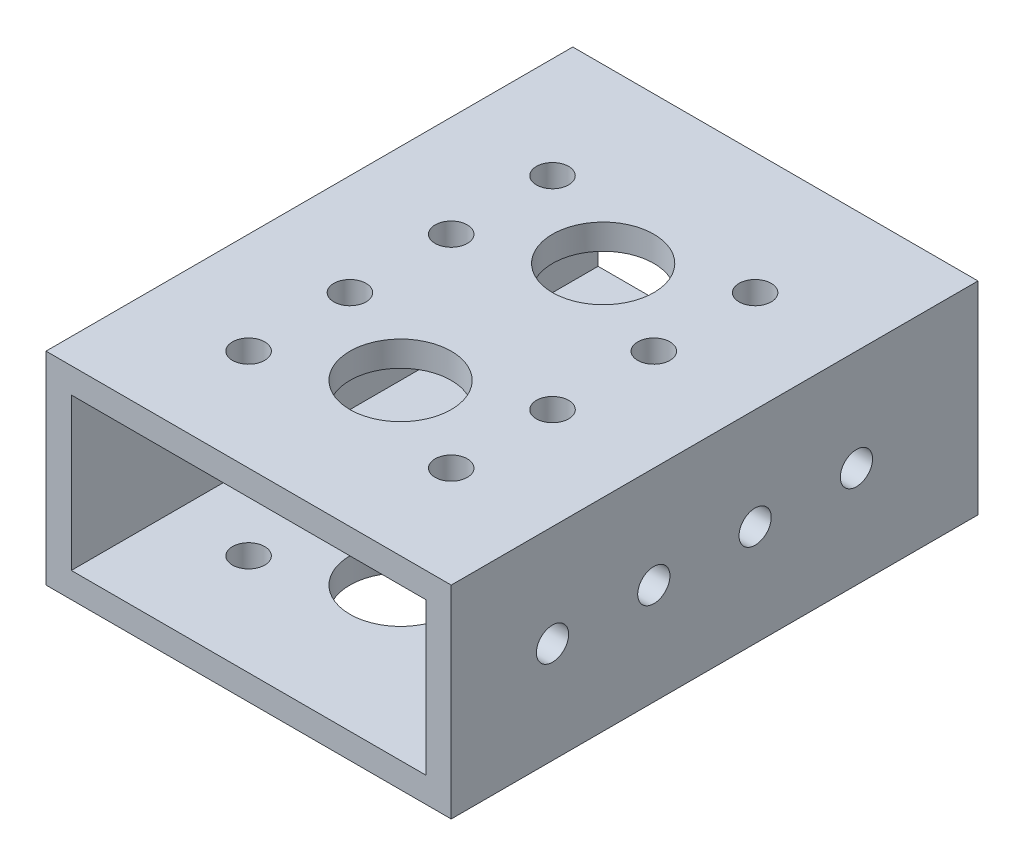
ISO-10303-21;
HEADER;
FILE_DESCRIPTION(('STEP AP214'),'2;1');
FILE_NAME('part.step','',(''),(''),'','','');
FILE_SCHEMA(('AUTOMOTIVE_DESIGN { 1 0 10303 214 1 1 1 1 }'));
ENDSEC;
DATA;
#1=APPLICATION_CONTEXT('core data for automotive mechanical design processes');
#2=APPLICATION_PROTOCOL_DEFINITION('international standard','automotive_design',2000,#1);
#3=PRODUCT_CONTEXT('',#1,'mechanical');
#4=PRODUCT('Part','Part','',(#3));
#5=PRODUCT_RELATED_PRODUCT_CATEGORY('part','',(#4));
#6=PRODUCT_DEFINITION_FORMATION('','',#4);
#7=PRODUCT_DEFINITION_CONTEXT('part definition',#1,'design');
#8=PRODUCT_DEFINITION('design','',#6,#7);
#9=PRODUCT_DEFINITION_SHAPE('','',#8);
#10=(LENGTH_UNIT() NAMED_UNIT(*) SI_UNIT(.MILLI.,.METRE.));
#11=(NAMED_UNIT(*) PLANE_ANGLE_UNIT() SI_UNIT($,.RADIAN.));
#12=(NAMED_UNIT(*) SI_UNIT($,.STERADIAN.) SOLID_ANGLE_UNIT());
#13=UNCERTAINTY_MEASURE_WITH_UNIT(LENGTH_MEASURE(1.E-05),#10,'distance_accuracy_value','');
#14=(GEOMETRIC_REPRESENTATION_CONTEXT(3) GLOBAL_UNCERTAINTY_ASSIGNED_CONTEXT((#13)) GLOBAL_UNIT_ASSIGNED_CONTEXT((#10,
#11,#12)) REPRESENTATION_CONTEXT('',''));
#15=CARTESIAN_POINT('',(0.,0.,0.));
#16=DIRECTION('',(0.,0.,1.));
#17=DIRECTION('',(1.,0.,0.));
#18=AXIS2_PLACEMENT_3D('',#15,#16,#17);
#19=CARTESIAN_POINT('',(0.,0.,66.04));
#20=DIRECTION('',(0.,0.,-1.));
#21=DIRECTION('',(-1.,0.,0.));
#22=AXIS2_PLACEMENT_3D('',#19,#20,#21);
#23=PLANE('',#22);
#24=DIRECTION('',(0.,-1.,0.));
#25=VECTOR('',#24,1.);
#26=CARTESIAN_POINT('',(0.,0.,66.04));
#27=LINE('',#26,#25);
#28=CARTESIAN_POINT('',(0.,25.4,66.04));
#29=VERTEX_POINT('',#28);
#30=CARTESIAN_POINT('',(0.,0.,66.04));
#31=VERTEX_POINT('',#30);
#32=EDGE_CURVE('E140',#29,#31,#27,.T.);
#33=ORIENTED_EDGE('',*,*,#32,.T.);
#34=DIRECTION('',(1.,0.,0.));
#35=VECTOR('',#34,1.);
#36=CARTESIAN_POINT('',(0.,0.,66.04));
#37=LINE('',#36,#35);
#38=CARTESIAN_POINT('',(50.8,0.,66.04));
#39=VERTEX_POINT('',#38);
#40=EDGE_CURVE('E143',#31,#39,#37,.T.);
#41=ORIENTED_EDGE('',*,*,#40,.T.);
#42=DIRECTION('',(0.,1.,0.));
#43=VECTOR('',#42,1.);
#44=CARTESIAN_POINT('',(50.8,0.,66.04));
#45=LINE('',#44,#43);
#46=CARTESIAN_POINT('',(50.8,25.4,66.04));
#47=VERTEX_POINT('',#46);
#48=EDGE_CURVE('E146',#39,#47,#45,.T.);
#49=ORIENTED_EDGE('',*,*,#48,.T.);
#50=DIRECTION('',(-1.,0.,0.));
#51=VECTOR('',#50,1.);
#52=CARTESIAN_POINT('',(0.,25.4,66.04));
#53=LINE('',#52,#51);
#54=EDGE_CURVE('E148',#47,#29,#53,.T.);
#55=ORIENTED_EDGE('',*,*,#54,.T.);
#56=EDGE_LOOP('',(#33,#41,#49,#55));
#57=FACE_BOUND('',#56,.T.);
#58=DIRECTION('',(0.,-1.,0.));
#59=VECTOR('',#58,1.);
#60=CARTESIAN_POINT('',(3.175,3.175,66.04));
#61=LINE('',#60,#59);
#62=CARTESIAN_POINT('',(3.175,22.225,66.04));
#63=VERTEX_POINT('',#62);
#64=CARTESIAN_POINT('',(3.175,3.175,66.04));
#65=VERTEX_POINT('',#64);
#66=EDGE_CURVE('E102',#63,#65,#61,.T.);
#67=ORIENTED_EDGE('',*,*,#66,.F.);
#68=DIRECTION('',(-1.,0.,0.));
#69=VECTOR('',#68,1.);
#70=CARTESIAN_POINT('',(3.175,22.225,66.04));
#71=LINE('',#70,#69);
#72=CARTESIAN_POINT('',(47.625,22.225,66.04));
#73=VERTEX_POINT('',#72);
#74=EDGE_CURVE('E124',#73,#63,#71,.T.);
#75=ORIENTED_EDGE('',*,*,#74,.F.);
#76=DIRECTION('',(0.,1.,0.));
#77=VECTOR('',#76,1.);
#78=CARTESIAN_POINT('',(47.625,3.175,66.04));
#79=LINE('',#78,#77);
#80=CARTESIAN_POINT('',(47.625,3.175,66.04));
#81=VERTEX_POINT('',#80);
#82=EDGE_CURVE('E122',#81,#73,#79,.T.);
#83=ORIENTED_EDGE('',*,*,#82,.F.);
#84=DIRECTION('',(1.,0.,0.));
#85=VECTOR('',#84,1.);
#86=CARTESIAN_POINT('',(3.175,3.175,66.04));
#87=LINE('',#86,#85);
#88=EDGE_CURVE('E110',#65,#81,#87,.T.);
#89=ORIENTED_EDGE('',*,*,#88,.F.);
#90=EDGE_LOOP('',(#67,#75,#83,#89));
#91=FACE_BOUND('',#90,.T.);
#92=ADVANCED_FACE('F35',(#57,#91),#23,.F.);
#93=CARTESIAN_POINT('',(0.,0.,0.));
#94=DIRECTION('',(0.,0.,-1.));
#95=DIRECTION('',(-1.,0.,0.));
#96=AXIS2_PLACEMENT_3D('',#93,#94,#95);
#97=PLANE('',#96);
#98=DIRECTION('',(0.,-1.,0.));
#99=VECTOR('',#98,1.);
#100=CARTESIAN_POINT('',(0.,0.,0.));
#101=LINE('',#100,#99);
#102=CARTESIAN_POINT('',(0.,25.4,0.));
#103=VERTEX_POINT('',#102);
#104=CARTESIAN_POINT('',(0.,0.,0.));
#105=VERTEX_POINT('',#104);
#106=EDGE_CURVE('E118',#103,#105,#101,.T.);
#107=ORIENTED_EDGE('',*,*,#106,.F.);
#108=DIRECTION('',(-1.,0.,0.));
#109=VECTOR('',#108,1.);
#110=CARTESIAN_POINT('',(0.,25.4,0.));
#111=LINE('',#110,#109);
#112=CARTESIAN_POINT('',(50.8,25.4,0.));
#113=VERTEX_POINT('',#112);
#114=EDGE_CURVE('E144',#113,#103,#111,.T.);
#115=ORIENTED_EDGE('',*,*,#114,.F.);
#116=DIRECTION('',(0.,1.,0.));
#117=VECTOR('',#116,1.);
#118=CARTESIAN_POINT('',(50.8,0.,0.));
#119=LINE('',#118,#117);
#120=CARTESIAN_POINT('',(50.8,0.,0.));
#121=VERTEX_POINT('',#120);
#122=EDGE_CURVE('E155',#121,#113,#119,.T.);
#123=ORIENTED_EDGE('',*,*,#122,.F.);
#124=DIRECTION('',(1.,0.,0.));
#125=VECTOR('',#124,1.);
#126=CARTESIAN_POINT('',(0.,0.,0.));
#127=LINE('',#126,#125);
#128=EDGE_CURVE('E153',#105,#121,#127,.T.);
#129=ORIENTED_EDGE('',*,*,#128,.F.);
#130=EDGE_LOOP('',(#107,#115,#123,#129));
#131=FACE_BOUND('',#130,.T.);
#132=DIRECTION('',(-1.,0.,0.));
#133=VECTOR('',#132,1.);
#134=CARTESIAN_POINT('',(3.175,22.225,0.));
#135=LINE('',#134,#133);
#136=CARTESIAN_POINT('',(47.625,22.225,0.));
#137=VERTEX_POINT('',#136);
#138=CARTESIAN_POINT('',(3.175,22.225,0.));
#139=VERTEX_POINT('',#138);
#140=EDGE_CURVE('E111',#137,#139,#135,.T.);
#141=ORIENTED_EDGE('',*,*,#140,.T.);
#142=DIRECTION('',(0.,-1.,0.));
#143=VECTOR('',#142,1.);
#144=CARTESIAN_POINT('',(3.175,3.175,0.));
#145=LINE('',#144,#143);
#146=CARTESIAN_POINT('',(3.175,3.175,0.));
#147=VERTEX_POINT('',#146);
#148=EDGE_CURVE('E60',#139,#147,#145,.T.);
#149=ORIENTED_EDGE('',*,*,#148,.T.);
#150=DIRECTION('',(1.,0.,0.));
#151=VECTOR('',#150,1.);
#152=CARTESIAN_POINT('',(3.175,3.175,0.));
#153=LINE('',#152,#151);
#154=CARTESIAN_POINT('',(47.625,3.175,0.));
#155=VERTEX_POINT('',#154);
#156=EDGE_CURVE('E117',#147,#155,#153,.T.);
#157=ORIENTED_EDGE('',*,*,#156,.T.);
#158=DIRECTION('',(0.,1.,0.));
#159=VECTOR('',#158,1.);
#160=CARTESIAN_POINT('',(47.625,3.175,0.));
#161=LINE('',#160,#159);
#162=EDGE_CURVE('E132',#155,#137,#161,.T.);
#163=ORIENTED_EDGE('',*,*,#162,.T.);
#164=EDGE_LOOP('',(#141,#149,#157,#163));
#165=FACE_BOUND('',#164,.T.);
#166=ADVANCED_FACE('F345',(#131,#165),#97,.T.);
#167=CARTESIAN_POINT('',(0.,0.,66.04));
#168=DIRECTION('',(1.,0.,0.));
#169=DIRECTION('',(0.,0.,-1.));
#170=AXIS2_PLACEMENT_3D('',#167,#168,#169);
#171=PLANE('',#170);
#172=CARTESIAN_POINT('',(0.,12.7,53.34));
#173=DIRECTION('',(1.,0.,0.));
#174=DIRECTION('',(0.,0.,-1.));
#175=AXIS2_PLACEMENT_3D('',#172,#173,#174);
#176=CIRCLE('',#175,2.0193);
#177=CARTESIAN_POINT('',(0.,12.7,51.3207));
#178=VERTEX_POINT('',#177);
#179=EDGE_CURVE('E246',#178,#178,#176,.T.);
#180=ORIENTED_EDGE('',*,*,#179,.T.);
#181=EDGE_LOOP('',(#180));
#182=FACE_BOUND('',#181,.T.);
#183=CARTESIAN_POINT('',(0.,12.7,40.64));
#184=DIRECTION('',(1.,0.,0.));
#185=DIRECTION('',(0.,0.,-1.));
#186=AXIS2_PLACEMENT_3D('',#183,#184,#185);
#187=CIRCLE('',#186,2.01929999999999);
#188=CARTESIAN_POINT('',(0.,12.7,38.6207));
#189=VERTEX_POINT('',#188);
#190=EDGE_CURVE('E231',#189,#189,#187,.T.);
#191=ORIENTED_EDGE('',*,*,#190,.T.);
#192=EDGE_LOOP('',(#191));
#193=FACE_BOUND('',#192,.T.);
#194=CARTESIAN_POINT('',(0.,12.7,27.94));
#195=DIRECTION('',(1.,0.,0.));
#196=DIRECTION('',(0.,0.,-1.));
#197=AXIS2_PLACEMENT_3D('',#194,#195,#196);
#198=CIRCLE('',#197,2.0193);
#199=CARTESIAN_POINT('',(0.,12.7,25.9207));
#200=VERTEX_POINT('',#199);
#201=EDGE_CURVE('E227',#200,#200,#198,.T.);
#202=ORIENTED_EDGE('',*,*,#201,.T.);
#203=EDGE_LOOP('',(#202));
#204=FACE_BOUND('',#203,.T.);
#205=CARTESIAN_POINT('',(0.,12.7,15.24));
#206=DIRECTION('',(1.,0.,0.));
#207=DIRECTION('',(0.,0.,-1.));
#208=AXIS2_PLACEMENT_3D('',#205,#206,#207);
#209=CIRCLE('',#208,2.0193);
#210=CARTESIAN_POINT('',(0.,12.7,13.2207));
#211=VERTEX_POINT('',#210);
#212=EDGE_CURVE('E223',#211,#211,#209,.T.);
#213=ORIENTED_EDGE('',*,*,#212,.T.);
#214=EDGE_LOOP('',(#213));
#215=FACE_BOUND('',#214,.T.);
#216=ORIENTED_EDGE('',*,*,#106,.T.);
#217=DIRECTION('',(0.,0.,-1.));
#218=VECTOR('',#217,1.);
#219=CARTESIAN_POINT('',(0.,0.,66.04));
#220=LINE('',#219,#218);
#221=EDGE_CURVE('E11',#31,#105,#220,.T.);
#222=ORIENTED_EDGE('',*,*,#221,.F.);
#223=ORIENTED_EDGE('',*,*,#32,.F.);
#224=DIRECTION('',(0.,0.,-1.));
#225=VECTOR('',#224,1.);
#226=CARTESIAN_POINT('',(0.,25.4,66.04));
#227=LINE('',#226,#225);
#228=EDGE_CURVE('E150',#29,#103,#227,.T.);
#229=ORIENTED_EDGE('',*,*,#228,.T.);
#230=EDGE_LOOP('',(#216,#222,#223,#229));
#231=FACE_BOUND('',#230,.T.);
#232=ADVANCED_FACE('F37',(#182,#193,#204,#215,#231),#171,.F.);
#233=CARTESIAN_POINT('',(0.,0.,66.04));
#234=DIRECTION('',(0.,1.,0.));
#235=DIRECTION('',(0.,0.,1.));
#236=AXIS2_PLACEMENT_3D('',#233,#234,#235);
#237=PLANE('',#236);
#238=CARTESIAN_POINT('',(38.1,0.,40.64));
#239=DIRECTION('',(0.,1.,0.));
#240=DIRECTION('',(0.,0.,1.));
#241=AXIS2_PLACEMENT_3D('',#238,#239,#240);
#242=CIRCLE('',#241,2.01930000000001);
#243=CARTESIAN_POINT('',(38.1,0.,42.6593));
#244=VERTEX_POINT('',#243);
#245=EDGE_CURVE('E130',#244,#244,#242,.T.);
#246=ORIENTED_EDGE('',*,*,#245,.T.);
#247=EDGE_LOOP('',(#246));
#248=FACE_BOUND('',#247,.T.);
#249=CARTESIAN_POINT('',(12.7,0.,40.64));
#250=DIRECTION('',(0.,1.,0.));
#251=DIRECTION('',(0.,0.,1.));
#252=AXIS2_PLACEMENT_3D('',#249,#250,#251);
#253=CIRCLE('',#252,2.0193);
#254=CARTESIAN_POINT('',(12.7,0.,42.6593));
#255=VERTEX_POINT('',#254);
#256=EDGE_CURVE('E214',#255,#255,#253,.T.);
#257=ORIENTED_EDGE('',*,*,#256,.T.);
#258=EDGE_LOOP('',(#257));
#259=FACE_BOUND('',#258,.T.);
#260=CARTESIAN_POINT('',(38.1,0.,53.34));
#261=DIRECTION('',(0.,1.,0.));
#262=DIRECTION('',(0.,0.,1.));
#263=AXIS2_PLACEMENT_3D('',#260,#261,#262);
#264=CIRCLE('',#263,2.0193);
#265=CARTESIAN_POINT('',(38.1,0.,55.3593));
#266=VERTEX_POINT('',#265);
#267=EDGE_CURVE('E209',#266,#266,#264,.T.);
#268=ORIENTED_EDGE('',*,*,#267,.T.);
#269=EDGE_LOOP('',(#268));
#270=FACE_BOUND('',#269,.T.);
#271=CARTESIAN_POINT('',(25.4,0.,46.99));
#272=DIRECTION('',(0.,1.,0.));
#273=DIRECTION('',(0.,0.,1.));
#274=AXIS2_PLACEMENT_3D('',#271,#272,#273);
#275=CIRCLE('',#274,6.35000000000002);
#276=CARTESIAN_POINT('',(25.4,0.,53.34));
#277=VERTEX_POINT('',#276);
#278=EDGE_CURVE('E204',#277,#277,#275,.T.);
#279=ORIENTED_EDGE('',*,*,#278,.T.);
#280=EDGE_LOOP('',(#279));
#281=FACE_BOUND('',#280,.T.);
#282=CARTESIAN_POINT('',(12.7,0.,27.94));
#283=DIRECTION('',(0.,1.,0.));
#284=DIRECTION('',(0.,0.,1.));
#285=AXIS2_PLACEMENT_3D('',#282,#283,#284);
#286=CIRCLE('',#285,2.0193);
#287=CARTESIAN_POINT('',(12.7,0.,29.9593));
#288=VERTEX_POINT('',#287);
#289=EDGE_CURVE('E199',#288,#288,#286,.T.);
#290=ORIENTED_EDGE('',*,*,#289,.T.);
#291=EDGE_LOOP('',(#290));
#292=FACE_BOUND('',#291,.T.);
#293=CARTESIAN_POINT('',(38.1,0.,27.94));
#294=DIRECTION('',(0.,1.,0.));
#295=DIRECTION('',(0.,0.,1.));
#296=AXIS2_PLACEMENT_3D('',#293,#294,#295);
#297=CIRCLE('',#296,2.0193);
#298=CARTESIAN_POINT('',(38.1,0.,29.9593));
#299=VERTEX_POINT('',#298);
#300=EDGE_CURVE('E194',#299,#299,#297,.T.);
#301=ORIENTED_EDGE('',*,*,#300,.T.);
#302=EDGE_LOOP('',(#301));
#303=FACE_BOUND('',#302,.T.);
#304=CARTESIAN_POINT('',(12.7,0.,15.24));
#305=DIRECTION('',(0.,1.,0.));
#306=DIRECTION('',(0.,0.,1.));
#307=AXIS2_PLACEMENT_3D('',#304,#305,#306);
#308=CIRCLE('',#307,2.0193);
#309=CARTESIAN_POINT('',(12.7,0.,17.2593));
#310=VERTEX_POINT('',#309);
#311=EDGE_CURVE('E189',#310,#310,#308,.T.);
#312=ORIENTED_EDGE('',*,*,#311,.T.);
#313=EDGE_LOOP('',(#312));
#314=FACE_BOUND('',#313,.T.);
#315=CARTESIAN_POINT('',(38.1,0.,15.24));
#316=DIRECTION('',(0.,1.,0.));
#317=DIRECTION('',(0.,0.,1.));
#318=AXIS2_PLACEMENT_3D('',#315,#316,#317);
#319=CIRCLE('',#318,2.0193);
#320=CARTESIAN_POINT('',(38.1,0.,17.2593));
#321=VERTEX_POINT('',#320);
#322=EDGE_CURVE('E184',#321,#321,#319,.T.);
#323=ORIENTED_EDGE('',*,*,#322,.T.);
#324=EDGE_LOOP('',(#323));
#325=FACE_BOUND('',#324,.T.);
#326=CARTESIAN_POINT('',(25.4,0.,21.59));
#327=DIRECTION('',(0.,1.,0.));
#328=DIRECTION('',(0.,0.,1.));
#329=AXIS2_PLACEMENT_3D('',#326,#327,#328);
#330=CIRCLE('',#329,6.35000000000002);
#331=CARTESIAN_POINT('',(25.4,0.,27.94));
#332=VERTEX_POINT('',#331);
#333=EDGE_CURVE('E179',#332,#332,#330,.T.);
#334=ORIENTED_EDGE('',*,*,#333,.T.);
#335=EDGE_LOOP('',(#334));
#336=FACE_BOUND('',#335,.T.);
#337=CARTESIAN_POINT('',(12.7,0.,53.34));
#338=DIRECTION('',(0.,1.,0.));
#339=DIRECTION('',(0.,0.,1.));
#340=AXIS2_PLACEMENT_3D('',#337,#338,#339);
#341=CIRCLE('',#340,2.0193);
#342=CARTESIAN_POINT('',(12.7,0.,55.3593));
#343=VERTEX_POINT('',#342);
#344=EDGE_CURVE('E174',#343,#343,#341,.T.);
#345=ORIENTED_EDGE('',*,*,#344,.T.);
#346=EDGE_LOOP('',(#345));
#347=FACE_BOUND('',#346,.T.);
#348=ORIENTED_EDGE('',*,*,#128,.T.);
#349=DIRECTION('',(0.,0.,-1.));
#350=VECTOR('',#349,1.);
#351=CARTESIAN_POINT('',(50.8,0.,66.04));
#352=LINE('',#351,#350);
#353=EDGE_CURVE('E44',#39,#121,#352,.T.);
#354=ORIENTED_EDGE('',*,*,#353,.F.);
#355=ORIENTED_EDGE('',*,*,#40,.F.);
#356=ORIENTED_EDGE('',*,*,#221,.T.);
#357=EDGE_LOOP('',(#348,#354,#355,#356));
#358=FACE_BOUND('',#357,.T.);
#359=ADVANCED_FACE('F318',(#248,#259,#270,#281,#292,#303,#314,#325,#336,#347,#358),#237,.F.);
#360=CARTESIAN_POINT('',(50.8,0.,66.04));
#361=DIRECTION('',(-1.,0.,0.));
#362=DIRECTION('',(0.,0.,1.));
#363=AXIS2_PLACEMENT_3D('',#360,#361,#362);
#364=PLANE('',#363);
#365=CARTESIAN_POINT('',(50.8,12.7,53.34));
#366=DIRECTION('',(1.,0.,0.));
#367=DIRECTION('',(0.,0.,-1.));
#368=AXIS2_PLACEMENT_3D('',#365,#366,#367);
#369=CIRCLE('',#368,2.0193);
#370=CARTESIAN_POINT('',(50.8,12.7,51.3207));
#371=VERTEX_POINT('',#370);
#372=EDGE_CURVE('E219',#371,#371,#369,.T.);
#373=ORIENTED_EDGE('',*,*,#372,.F.);
#374=EDGE_LOOP('',(#373));
#375=FACE_BOUND('',#374,.T.);
#376=CARTESIAN_POINT('',(50.8,12.7,40.64));
#377=DIRECTION('',(1.,0.,0.));
#378=DIRECTION('',(0.,0.,-1.));
#379=AXIS2_PLACEMENT_3D('',#376,#377,#378);
#380=CIRCLE('',#379,2.01929999999999);
#381=CARTESIAN_POINT('',(50.8,12.7,38.6207));
#382=VERTEX_POINT('',#381);
#383=EDGE_CURVE('E671',#382,#382,#380,.T.);
#384=ORIENTED_EDGE('',*,*,#383,.F.);
#385=EDGE_LOOP('',(#384));
#386=FACE_BOUND('',#385,.T.);
#387=CARTESIAN_POINT('',(50.8,12.7,27.94));
#388=DIRECTION('',(1.,0.,0.));
#389=DIRECTION('',(0.,0.,-1.));
#390=AXIS2_PLACEMENT_3D('',#387,#388,#389);
#391=CIRCLE('',#390,2.0193);
#392=CARTESIAN_POINT('',(50.8,12.7,25.9207));
#393=VERTEX_POINT('',#392);
#394=EDGE_CURVE('E668',#393,#393,#391,.T.);
#395=ORIENTED_EDGE('',*,*,#394,.F.);
#396=EDGE_LOOP('',(#395));
#397=FACE_BOUND('',#396,.T.);
#398=CARTESIAN_POINT('',(50.8,12.7,15.24));
#399=DIRECTION('',(1.,0.,0.));
#400=DIRECTION('',(0.,0.,-1.));
#401=AXIS2_PLACEMENT_3D('',#398,#399,#400);
#402=CIRCLE('',#401,2.0193);
#403=CARTESIAN_POINT('',(50.8,12.7,13.2207));
#404=VERTEX_POINT('',#403);
#405=EDGE_CURVE('E665',#404,#404,#402,.T.);
#406=ORIENTED_EDGE('',*,*,#405,.F.);
#407=EDGE_LOOP('',(#406));
#408=FACE_BOUND('',#407,.T.);
#409=ORIENTED_EDGE('',*,*,#122,.T.);
#410=DIRECTION('',(0.,0.,-1.));
#411=VECTOR('',#410,1.);
#412=CARTESIAN_POINT('',(50.8,25.4,66.04));
#413=LINE('',#412,#411);
#414=EDGE_CURVE('E160',#47,#113,#413,.T.);
#415=ORIENTED_EDGE('',*,*,#414,.F.);
#416=ORIENTED_EDGE('',*,*,#48,.F.);
#417=ORIENTED_EDGE('',*,*,#353,.T.);
#418=EDGE_LOOP('',(#409,#415,#416,#417));
#419=FACE_BOUND('',#418,.T.);
#420=ADVANCED_FACE('F359',(#375,#386,#397,#408,#419),#364,.F.);
#421=CARTESIAN_POINT('',(0.,25.4,66.04));
#422=DIRECTION('',(0.,-1.,0.));
#423=DIRECTION('',(0.,0.,-1.));
#424=AXIS2_PLACEMENT_3D('',#421,#422,#423);
#425=PLANE('',#424);
#426=CARTESIAN_POINT('',(38.1,25.4,40.64));
#427=DIRECTION('',(0.,1.,0.));
#428=DIRECTION('',(0.,0.,-1.));
#429=AXIS2_PLACEMENT_3D('',#426,#427,#428);
#430=CIRCLE('',#429,2.01930000000001);
#431=CARTESIAN_POINT('',(38.1,25.4,38.6207));
#432=VERTEX_POINT('',#431);
#433=EDGE_CURVE('E257',#432,#432,#430,.T.);
#434=ORIENTED_EDGE('',*,*,#433,.F.);
#435=EDGE_LOOP('',(#434));
#436=FACE_BOUND('',#435,.T.);
#437=CARTESIAN_POINT('',(12.7,25.4,40.64));
#438=DIRECTION('',(0.,1.,0.));
#439=DIRECTION('',(0.,0.,1.));
#440=AXIS2_PLACEMENT_3D('',#437,#438,#439);
#441=CIRCLE('',#440,2.0193);
#442=CARTESIAN_POINT('',(12.7,25.4,42.6593));
#443=VERTEX_POINT('',#442);
#444=EDGE_CURVE('E253',#443,#443,#441,.T.);
#445=ORIENTED_EDGE('',*,*,#444,.F.);
#446=EDGE_LOOP('',(#445));
#447=FACE_BOUND('',#446,.T.);
#448=CARTESIAN_POINT('',(38.1,25.4,53.34));
#449=DIRECTION('',(0.,1.,0.));
#450=DIRECTION('',(0.,0.,-1.));
#451=AXIS2_PLACEMENT_3D('',#448,#449,#450);
#452=CIRCLE('',#451,2.0193);
#453=CARTESIAN_POINT('',(38.1,25.4,51.3207));
#454=VERTEX_POINT('',#453);
#455=EDGE_CURVE('E256',#454,#454,#452,.T.);
#456=ORIENTED_EDGE('',*,*,#455,.F.);
#457=EDGE_LOOP('',(#456));
#458=FACE_BOUND('',#457,.T.);
#459=CARTESIAN_POINT('',(25.4,25.4,46.99));
#460=DIRECTION('',(0.,1.,0.));
#461=DIRECTION('',(0.,0.,1.));
#462=AXIS2_PLACEMENT_3D('',#459,#460,#461);
#463=CIRCLE('',#462,6.35000000000002);
#464=CARTESIAN_POINT('',(25.4,25.4,53.34));
#465=VERTEX_POINT('',#464);
#466=EDGE_CURVE('E261',#465,#465,#463,.T.);
#467=ORIENTED_EDGE('',*,*,#466,.F.);
#468=EDGE_LOOP('',(#467));
#469=FACE_BOUND('',#468,.T.);
#470=CARTESIAN_POINT('',(12.7,25.4,27.94));
#471=DIRECTION('',(0.,1.,0.));
#472=DIRECTION('',(0.,0.,1.));
#473=AXIS2_PLACEMENT_3D('',#470,#471,#472);
#474=CIRCLE('',#473,2.0193);
#475=CARTESIAN_POINT('',(12.7,25.4,29.9593));
#476=VERTEX_POINT('',#475);
#477=EDGE_CURVE('E260',#476,#476,#474,.T.);
#478=ORIENTED_EDGE('',*,*,#477,.F.);
#479=EDGE_LOOP('',(#478));
#480=FACE_BOUND('',#479,.T.);
#481=CARTESIAN_POINT('',(38.1,25.4,27.94));
#482=DIRECTION('',(0.,1.,0.));
#483=DIRECTION('',(0.,0.,-1.));
#484=AXIS2_PLACEMENT_3D('',#481,#482,#483);
#485=CIRCLE('',#484,2.0193);
#486=CARTESIAN_POINT('',(38.1,25.4,25.9207));
#487=VERTEX_POINT('',#486);
#488=EDGE_CURVE('E268',#487,#487,#485,.T.);
#489=ORIENTED_EDGE('',*,*,#488,.F.);
#490=EDGE_LOOP('',(#489));
#491=FACE_BOUND('',#490,.T.);
#492=CARTESIAN_POINT('',(12.7,25.4,15.24));
#493=DIRECTION('',(0.,1.,0.));
#494=DIRECTION('',(0.,0.,1.));
#495=AXIS2_PLACEMENT_3D('',#492,#493,#494);
#496=CIRCLE('',#495,2.0193);
#497=CARTESIAN_POINT('',(12.7,25.4,17.2593));
#498=VERTEX_POINT('',#497);
#499=EDGE_CURVE('E271',#498,#498,#496,.T.);
#500=ORIENTED_EDGE('',*,*,#499,.F.);
#501=EDGE_LOOP('',(#500));
#502=FACE_BOUND('',#501,.T.);
#503=CARTESIAN_POINT('',(38.1,25.4,15.24));
#504=DIRECTION('',(0.,1.,0.));
#505=DIRECTION('',(0.,0.,-1.));
#506=AXIS2_PLACEMENT_3D('',#503,#504,#505);
#507=CIRCLE('',#506,2.0193);
#508=CARTESIAN_POINT('',(38.1,25.4,13.2207));
#509=VERTEX_POINT('',#508);
#510=EDGE_CURVE('E252',#509,#509,#507,.T.);
#511=ORIENTED_EDGE('',*,*,#510,.F.);
#512=EDGE_LOOP('',(#511));
#513=FACE_BOUND('',#512,.T.);
#514=CARTESIAN_POINT('',(25.4,25.4,21.59));
#515=DIRECTION('',(0.,1.,0.));
#516=DIRECTION('',(0.,0.,1.));
#517=AXIS2_PLACEMENT_3D('',#514,#515,#516);
#518=CIRCLE('',#517,6.35000000000002);
#519=CARTESIAN_POINT('',(25.4,25.4,27.94));
#520=VERTEX_POINT('',#519);
#521=EDGE_CURVE('E249',#520,#520,#518,.T.);
#522=ORIENTED_EDGE('',*,*,#521,.F.);
#523=EDGE_LOOP('',(#522));
#524=FACE_BOUND('',#523,.T.);
#525=CARTESIAN_POINT('',(12.7,25.4,53.34));
#526=DIRECTION('',(0.,1.,0.));
#527=DIRECTION('',(0.,0.,1.));
#528=AXIS2_PLACEMENT_3D('',#525,#526,#527);
#529=CIRCLE('',#528,2.0193);
#530=CARTESIAN_POINT('',(12.7,25.4,55.3593));
#531=VERTEX_POINT('',#530);
#532=EDGE_CURVE('E169',#531,#531,#529,.T.);
#533=ORIENTED_EDGE('',*,*,#532,.F.);
#534=EDGE_LOOP('',(#533));
#535=FACE_BOUND('',#534,.T.);
#536=ORIENTED_EDGE('',*,*,#114,.T.);
#537=ORIENTED_EDGE('',*,*,#228,.F.);
#538=ORIENTED_EDGE('',*,*,#54,.F.);
#539=ORIENTED_EDGE('',*,*,#414,.T.);
#540=EDGE_LOOP('',(#536,#537,#538,#539));
#541=FACE_BOUND('',#540,.T.);
#542=ADVANCED_FACE('F356',(#436,#447,#458,#469,#480,#491,#502,#513,#524,#535,#541),#425,.F.);
#543=CARTESIAN_POINT('',(3.175,3.175,66.04));
#544=DIRECTION('',(1.,0.,0.));
#545=DIRECTION('',(0.,0.,-1.));
#546=AXIS2_PLACEMENT_3D('',#543,#544,#545);
#547=PLANE('',#546);
#548=CARTESIAN_POINT('',(3.175,12.7,53.34));
#549=DIRECTION('',(1.,0.,0.));
#550=DIRECTION('',(0.,0.,-1.));
#551=AXIS2_PLACEMENT_3D('',#548,#549,#550);
#552=CIRCLE('',#551,2.0193);
#553=CARTESIAN_POINT('',(3.175,12.7,51.3207));
#554=VERTEX_POINT('',#553);
#555=EDGE_CURVE('E243',#554,#554,#552,.T.);
#556=ORIENTED_EDGE('',*,*,#555,.F.);
#557=EDGE_LOOP('',(#556));
#558=FACE_BOUND('',#557,.T.);
#559=CARTESIAN_POINT('',(3.175,12.7,40.64));
#560=DIRECTION('',(1.,0.,0.));
#561=DIRECTION('',(0.,0.,-1.));
#562=AXIS2_PLACEMENT_3D('',#559,#560,#561);
#563=CIRCLE('',#562,2.01929999999999);
#564=CARTESIAN_POINT('',(3.175,12.7,38.6207));
#565=VERTEX_POINT('',#564);
#566=EDGE_CURVE('E226',#565,#565,#563,.T.);
#567=ORIENTED_EDGE('',*,*,#566,.F.);
#568=EDGE_LOOP('',(#567));
#569=FACE_BOUND('',#568,.T.);
#570=CARTESIAN_POINT('',(3.175,12.7,27.94));
#571=DIRECTION('',(1.,0.,0.));
#572=DIRECTION('',(0.,0.,-1.));
#573=AXIS2_PLACEMENT_3D('',#570,#571,#572);
#574=CIRCLE('',#573,2.0193);
#575=CARTESIAN_POINT('',(3.175,12.7,25.9207));
#576=VERTEX_POINT('',#575);
#577=EDGE_CURVE('E222',#576,#576,#574,.T.);
#578=ORIENTED_EDGE('',*,*,#577,.F.);
#579=EDGE_LOOP('',(#578));
#580=FACE_BOUND('',#579,.T.);
#581=CARTESIAN_POINT('',(3.175,12.7,15.24));
#582=DIRECTION('',(1.,0.,0.));
#583=DIRECTION('',(0.,0.,-1.));
#584=AXIS2_PLACEMENT_3D('',#581,#582,#583);
#585=CIRCLE('',#584,2.0193);
#586=CARTESIAN_POINT('',(3.175,12.7,13.2207));
#587=VERTEX_POINT('',#586);
#588=EDGE_CURVE('E218',#587,#587,#585,.T.);
#589=ORIENTED_EDGE('',*,*,#588,.F.);
#590=EDGE_LOOP('',(#589));
#591=FACE_BOUND('',#590,.T.);
#592=ORIENTED_EDGE('',*,*,#148,.F.);
#593=DIRECTION('',(0.,0.,-1.));
#594=VECTOR('',#593,1.);
#595=CARTESIAN_POINT('',(3.175,22.225,66.04));
#596=LINE('',#595,#594);
#597=EDGE_CURVE('E106',#63,#139,#596,.T.);
#598=ORIENTED_EDGE('',*,*,#597,.F.);
#599=ORIENTED_EDGE('',*,*,#66,.T.);
#600=DIRECTION('',(0.,0.,-1.));
#601=VECTOR('',#600,1.);
#602=CARTESIAN_POINT('',(3.175,3.175,66.04));
#603=LINE('',#602,#601);
#604=EDGE_CURVE('E105',#65,#147,#603,.T.);
#605=ORIENTED_EDGE('',*,*,#604,.T.);
#606=EDGE_LOOP('',(#592,#598,#599,#605));
#607=FACE_BOUND('',#606,.T.);
#608=ADVANCED_FACE('F104',(#558,#569,#580,#591,#607),#547,.T.);
#609=CARTESIAN_POINT('',(3.175,3.175,66.04));
#610=DIRECTION('',(0.,1.,0.));
#611=DIRECTION('',(0.,0.,1.));
#612=AXIS2_PLACEMENT_3D('',#609,#610,#611);
#613=PLANE('',#612);
#614=CARTESIAN_POINT('',(38.1,3.175,40.64));
#615=DIRECTION('',(0.,1.,0.));
#616=DIRECTION('',(0.,0.,1.));
#617=AXIS2_PLACEMENT_3D('',#614,#615,#616);
#618=CIRCLE('',#617,2.01930000000001);
#619=CARTESIAN_POINT('',(38.1,3.175,42.6593));
#620=VERTEX_POINT('',#619);
#621=EDGE_CURVE('E213',#620,#620,#618,.T.);
#622=ORIENTED_EDGE('',*,*,#621,.F.);
#623=EDGE_LOOP('',(#622));
#624=FACE_BOUND('',#623,.T.);
#625=CARTESIAN_POINT('',(12.7,3.175,40.64));
#626=DIRECTION('',(0.,1.,0.));
#627=DIRECTION('',(0.,0.,1.));
#628=AXIS2_PLACEMENT_3D('',#625,#626,#627);
#629=CIRCLE('',#628,2.0193);
#630=CARTESIAN_POINT('',(12.7,3.175,42.6593));
#631=VERTEX_POINT('',#630);
#632=EDGE_CURVE('E208',#631,#631,#629,.T.);
#633=ORIENTED_EDGE('',*,*,#632,.F.);
#634=EDGE_LOOP('',(#633));
#635=FACE_BOUND('',#634,.T.);
#636=CARTESIAN_POINT('',(38.1,3.175,53.34));
#637=DIRECTION('',(0.,1.,0.));
#638=DIRECTION('',(0.,0.,1.));
#639=AXIS2_PLACEMENT_3D('',#636,#637,#638);
#640=CIRCLE('',#639,2.0193);
#641=CARTESIAN_POINT('',(38.1,3.175,55.3593));
#642=VERTEX_POINT('',#641);
#643=EDGE_CURVE('E203',#642,#642,#640,.T.);
#644=ORIENTED_EDGE('',*,*,#643,.F.);
#645=EDGE_LOOP('',(#644));
#646=FACE_BOUND('',#645,.T.);
#647=CARTESIAN_POINT('',(25.4,3.175,46.99));
#648=DIRECTION('',(0.,1.,0.));
#649=DIRECTION('',(0.,0.,1.));
#650=AXIS2_PLACEMENT_3D('',#647,#648,#649);
#651=CIRCLE('',#650,6.35000000000002);
#652=CARTESIAN_POINT('',(25.4,3.175,53.34));
#653=VERTEX_POINT('',#652);
#654=EDGE_CURVE('E198',#653,#653,#651,.T.);
#655=ORIENTED_EDGE('',*,*,#654,.F.);
#656=EDGE_LOOP('',(#655));
#657=FACE_BOUND('',#656,.T.);
#658=CARTESIAN_POINT('',(12.7,3.175,27.94));
#659=DIRECTION('',(0.,1.,0.));
#660=DIRECTION('',(0.,0.,1.));
#661=AXIS2_PLACEMENT_3D('',#658,#659,#660);
#662=CIRCLE('',#661,2.0193);
#663=CARTESIAN_POINT('',(12.7,3.175,29.9593));
#664=VERTEX_POINT('',#663);
#665=EDGE_CURVE('E193',#664,#664,#662,.T.);
#666=ORIENTED_EDGE('',*,*,#665,.F.);
#667=EDGE_LOOP('',(#666));
#668=FACE_BOUND('',#667,.T.);
#669=CARTESIAN_POINT('',(38.1,3.175,27.94));
#670=DIRECTION('',(0.,1.,0.));
#671=DIRECTION('',(0.,0.,1.));
#672=AXIS2_PLACEMENT_3D('',#669,#670,#671);
#673=CIRCLE('',#672,2.0193);
#674=CARTESIAN_POINT('',(38.1,3.175,29.9593));
#675=VERTEX_POINT('',#674);
#676=EDGE_CURVE('E188',#675,#675,#673,.T.);
#677=ORIENTED_EDGE('',*,*,#676,.F.);
#678=EDGE_LOOP('',(#677));
#679=FACE_BOUND('',#678,.T.);
#680=CARTESIAN_POINT('',(12.7,3.175,15.24));
#681=DIRECTION('',(0.,1.,0.));
#682=DIRECTION('',(0.,0.,1.));
#683=AXIS2_PLACEMENT_3D('',#680,#681,#682);
#684=CIRCLE('',#683,2.0193);
#685=CARTESIAN_POINT('',(12.7,3.175,17.2593));
#686=VERTEX_POINT('',#685);
#687=EDGE_CURVE('E183',#686,#686,#684,.T.);
#688=ORIENTED_EDGE('',*,*,#687,.F.);
#689=EDGE_LOOP('',(#688));
#690=FACE_BOUND('',#689,.T.);
#691=CARTESIAN_POINT('',(38.1,3.175,15.24));
#692=DIRECTION('',(0.,1.,0.));
#693=DIRECTION('',(0.,0.,1.));
#694=AXIS2_PLACEMENT_3D('',#691,#692,#693);
#695=CIRCLE('',#694,2.0193);
#696=CARTESIAN_POINT('',(38.1,3.175,17.2593));
#697=VERTEX_POINT('',#696);
#698=EDGE_CURVE('E178',#697,#697,#695,.T.);
#699=ORIENTED_EDGE('',*,*,#698,.F.);
#700=EDGE_LOOP('',(#699));
#701=FACE_BOUND('',#700,.T.);
#702=CARTESIAN_POINT('',(25.4,3.175,21.59));
#703=DIRECTION('',(0.,1.,0.));
#704=DIRECTION('',(0.,0.,1.));
#705=AXIS2_PLACEMENT_3D('',#702,#703,#704);
#706=CIRCLE('',#705,6.35000000000002);
#707=CARTESIAN_POINT('',(25.4,3.175,27.94));
#708=VERTEX_POINT('',#707);
#709=EDGE_CURVE('E173',#708,#708,#706,.T.);
#710=ORIENTED_EDGE('',*,*,#709,.F.);
#711=EDGE_LOOP('',(#710));
#712=FACE_BOUND('',#711,.T.);
#713=CARTESIAN_POINT('',(12.7,3.175,53.34));
#714=DIRECTION('',(0.,1.,0.));
#715=DIRECTION('',(0.,0.,1.));
#716=AXIS2_PLACEMENT_3D('',#713,#714,#715);
#717=CIRCLE('',#716,2.0193);
#718=CARTESIAN_POINT('',(12.7,3.175,55.3593));
#719=VERTEX_POINT('',#718);
#720=EDGE_CURVE('E168',#719,#719,#717,.T.);
#721=ORIENTED_EDGE('',*,*,#720,.F.);
#722=EDGE_LOOP('',(#721));
#723=FACE_BOUND('',#722,.T.);
#724=ORIENTED_EDGE('',*,*,#156,.F.);
#725=ORIENTED_EDGE('',*,*,#604,.F.);
#726=ORIENTED_EDGE('',*,*,#88,.T.);
#727=DIRECTION('',(0.,0.,-1.));
#728=VECTOR('',#727,1.);
#729=CARTESIAN_POINT('',(47.625,3.175,66.04));
#730=LINE('',#729,#728);
#731=EDGE_CURVE('E119',#81,#155,#730,.T.);
#732=ORIENTED_EDGE('',*,*,#731,.T.);
#733=EDGE_LOOP('',(#724,#725,#726,#732));
#734=FACE_BOUND('',#733,.T.);
#735=ADVANCED_FACE('F114',(#624,#635,#646,#657,#668,#679,#690,#701,#712,#723,#734),#613,.T.);
#736=CARTESIAN_POINT('',(47.625,3.175,66.04));
#737=DIRECTION('',(-1.,0.,0.));
#738=DIRECTION('',(0.,0.,1.));
#739=AXIS2_PLACEMENT_3D('',#736,#737,#738);
#740=PLANE('',#739);
#741=CARTESIAN_POINT('',(47.625,12.7,53.34));
#742=DIRECTION('',(-1.,0.,0.));
#743=DIRECTION('',(0.,0.,1.));
#744=AXIS2_PLACEMENT_3D('',#741,#742,#743);
#745=CIRCLE('',#744,2.0193);
#746=CARTESIAN_POINT('',(47.625,12.7,55.3593));
#747=VERTEX_POINT('',#746);
#748=EDGE_CURVE('E39',#747,#747,#745,.T.);
#749=ORIENTED_EDGE('',*,*,#748,.F.);
#750=EDGE_LOOP('',(#749));
#751=FACE_BOUND('',#750,.T.);
#752=CARTESIAN_POINT('',(47.625,12.7,40.64));
#753=DIRECTION('',(-1.,0.,0.));
#754=DIRECTION('',(0.,0.,1.));
#755=AXIS2_PLACEMENT_3D('',#752,#753,#754);
#756=CIRCLE('',#755,2.01929999999999);
#757=CARTESIAN_POINT('',(47.625,12.7,42.6593));
#758=VERTEX_POINT('',#757);
#759=EDGE_CURVE('E224',#758,#758,#756,.T.);
#760=ORIENTED_EDGE('',*,*,#759,.F.);
#761=EDGE_LOOP('',(#760));
#762=FACE_BOUND('',#761,.T.);
#763=CARTESIAN_POINT('',(47.625,12.7,27.94));
#764=DIRECTION('',(-1.,0.,0.));
#765=DIRECTION('',(0.,0.,1.));
#766=AXIS2_PLACEMENT_3D('',#763,#764,#765);
#767=CIRCLE('',#766,2.0193);
#768=CARTESIAN_POINT('',(47.625,12.7,29.9593));
#769=VERTEX_POINT('',#768);
#770=EDGE_CURVE('E220',#769,#769,#767,.T.);
#771=ORIENTED_EDGE('',*,*,#770,.F.);
#772=EDGE_LOOP('',(#771));
#773=FACE_BOUND('',#772,.T.);
#774=CARTESIAN_POINT('',(47.625,12.7,15.24));
#775=DIRECTION('',(-1.,0.,0.));
#776=DIRECTION('',(0.,0.,1.));
#777=AXIS2_PLACEMENT_3D('',#774,#775,#776);
#778=CIRCLE('',#777,2.0193);
#779=CARTESIAN_POINT('',(47.625,12.7,17.2593));
#780=VERTEX_POINT('',#779);
#781=EDGE_CURVE('E215',#780,#780,#778,.T.);
#782=ORIENTED_EDGE('',*,*,#781,.F.);
#783=EDGE_LOOP('',(#782));
#784=FACE_BOUND('',#783,.T.);
#785=ORIENTED_EDGE('',*,*,#162,.F.);
#786=ORIENTED_EDGE('',*,*,#731,.F.);
#787=ORIENTED_EDGE('',*,*,#82,.T.);
#788=DIRECTION('',(0.,0.,-1.));
#789=VECTOR('',#788,1.);
#790=CARTESIAN_POINT('',(47.625,22.225,66.04));
#791=LINE('',#790,#789);
#792=EDGE_CURVE('E52',#73,#137,#791,.T.);
#793=ORIENTED_EDGE('',*,*,#792,.T.);
#794=EDGE_LOOP('',(#785,#786,#787,#793));
#795=FACE_BOUND('',#794,.T.);
#796=ADVANCED_FACE('F395',(#751,#762,#773,#784,#795),#740,.T.);
#797=CARTESIAN_POINT('',(3.175,22.225,66.04));
#798=DIRECTION('',(0.,-1.,0.));
#799=DIRECTION('',(1.,0.,0.));
#800=AXIS2_PLACEMENT_3D('',#797,#798,#799);
#801=PLANE('',#800);
#802=CARTESIAN_POINT('',(38.1,22.225,40.64));
#803=DIRECTION('',(0.,-1.,0.));
#804=DIRECTION('',(1.,0.,0.));
#805=AXIS2_PLACEMENT_3D('',#802,#803,#804);
#806=CIRCLE('',#805,2.01930000000001);
#807=CARTESIAN_POINT('',(40.1193,22.225,40.64));
#808=VERTEX_POINT('',#807);
#809=EDGE_CURVE('E210',#808,#808,#806,.T.);
#810=ORIENTED_EDGE('',*,*,#809,.F.);
#811=EDGE_LOOP('',(#810));
#812=FACE_BOUND('',#811,.T.);
#813=CARTESIAN_POINT('',(12.7,22.225,40.64));
#814=DIRECTION('',(0.,-1.,0.));
#815=DIRECTION('',(1.,0.,0.));
#816=AXIS2_PLACEMENT_3D('',#813,#814,#815);
#817=CIRCLE('',#816,2.0193);
#818=CARTESIAN_POINT('',(14.7193,22.225,40.64));
#819=VERTEX_POINT('',#818);
#820=EDGE_CURVE('E205',#819,#819,#817,.T.);
#821=ORIENTED_EDGE('',*,*,#820,.F.);
#822=EDGE_LOOP('',(#821));
#823=FACE_BOUND('',#822,.T.);
#824=CARTESIAN_POINT('',(38.1,22.225,53.34));
#825=DIRECTION('',(0.,-1.,0.));
#826=DIRECTION('',(1.,0.,0.));
#827=AXIS2_PLACEMENT_3D('',#824,#825,#826);
#828=CIRCLE('',#827,2.0193);
#829=CARTESIAN_POINT('',(40.1193,22.225,53.34));
#830=VERTEX_POINT('',#829);
#831=EDGE_CURVE('E200',#830,#830,#828,.T.);
#832=ORIENTED_EDGE('',*,*,#831,.F.);
#833=EDGE_LOOP('',(#832));
#834=FACE_BOUND('',#833,.T.);
#835=CARTESIAN_POINT('',(25.4,22.225,46.99));
#836=DIRECTION('',(0.,-1.,0.));
#837=DIRECTION('',(1.,0.,0.));
#838=AXIS2_PLACEMENT_3D('',#835,#836,#837);
#839=CIRCLE('',#838,6.35000000000002);
#840=CARTESIAN_POINT('',(31.75,22.225,46.99));
#841=VERTEX_POINT('',#840);
#842=EDGE_CURVE('E195',#841,#841,#839,.T.);
#843=ORIENTED_EDGE('',*,*,#842,.F.);
#844=EDGE_LOOP('',(#843));
#845=FACE_BOUND('',#844,.T.);
#846=CARTESIAN_POINT('',(12.7,22.225,27.94));
#847=DIRECTION('',(0.,-1.,0.));
#848=DIRECTION('',(1.,0.,0.));
#849=AXIS2_PLACEMENT_3D('',#846,#847,#848);
#850=CIRCLE('',#849,2.0193);
#851=CARTESIAN_POINT('',(14.7193,22.225,27.94));
#852=VERTEX_POINT('',#851);
#853=EDGE_CURVE('E190',#852,#852,#850,.T.);
#854=ORIENTED_EDGE('',*,*,#853,.F.);
#855=EDGE_LOOP('',(#854));
#856=FACE_BOUND('',#855,.T.);
#857=CARTESIAN_POINT('',(38.1,22.225,27.94));
#858=DIRECTION('',(0.,-1.,0.));
#859=DIRECTION('',(1.,0.,0.));
#860=AXIS2_PLACEMENT_3D('',#857,#858,#859);
#861=CIRCLE('',#860,2.0193);
#862=CARTESIAN_POINT('',(40.1193,22.225,27.94));
#863=VERTEX_POINT('',#862);
#864=EDGE_CURVE('E185',#863,#863,#861,.T.);
#865=ORIENTED_EDGE('',*,*,#864,.F.);
#866=EDGE_LOOP('',(#865));
#867=FACE_BOUND('',#866,.T.);
#868=CARTESIAN_POINT('',(12.7,22.225,15.24));
#869=DIRECTION('',(0.,-1.,0.));
#870=DIRECTION('',(1.,0.,0.));
#871=AXIS2_PLACEMENT_3D('',#868,#869,#870);
#872=CIRCLE('',#871,2.0193);
#873=CARTESIAN_POINT('',(14.7193,22.225,15.24));
#874=VERTEX_POINT('',#873);
#875=EDGE_CURVE('E180',#874,#874,#872,.T.);
#876=ORIENTED_EDGE('',*,*,#875,.F.);
#877=EDGE_LOOP('',(#876));
#878=FACE_BOUND('',#877,.T.);
#879=CARTESIAN_POINT('',(38.1,22.225,15.24));
#880=DIRECTION('',(0.,-1.,0.));
#881=DIRECTION('',(1.,0.,0.));
#882=AXIS2_PLACEMENT_3D('',#879,#880,#881);
#883=CIRCLE('',#882,2.0193);
#884=CARTESIAN_POINT('',(40.1193,22.225,15.24));
#885=VERTEX_POINT('',#884);
#886=EDGE_CURVE('E175',#885,#885,#883,.T.);
#887=ORIENTED_EDGE('',*,*,#886,.F.);
#888=EDGE_LOOP('',(#887));
#889=FACE_BOUND('',#888,.T.);
#890=CARTESIAN_POINT('',(25.4,22.225,21.59));
#891=DIRECTION('',(0.,-1.,0.));
#892=DIRECTION('',(1.,0.,0.));
#893=AXIS2_PLACEMENT_3D('',#890,#891,#892);
#894=CIRCLE('',#893,6.35000000000002);
#895=CARTESIAN_POINT('',(31.75,22.225,21.59));
#896=VERTEX_POINT('',#895);
#897=EDGE_CURVE('E170',#896,#896,#894,.T.);
#898=ORIENTED_EDGE('',*,*,#897,.F.);
#899=EDGE_LOOP('',(#898));
#900=FACE_BOUND('',#899,.T.);
#901=CARTESIAN_POINT('',(12.7,22.225,53.34));
#902=DIRECTION('',(0.,-1.,0.));
#903=DIRECTION('',(1.,0.,0.));
#904=AXIS2_PLACEMENT_3D('',#901,#902,#903);
#905=CIRCLE('',#904,2.0193);
#906=CARTESIAN_POINT('',(14.7193,22.225,53.34));
#907=VERTEX_POINT('',#906);
#908=EDGE_CURVE('E165',#907,#907,#905,.T.);
#909=ORIENTED_EDGE('',*,*,#908,.F.);
#910=EDGE_LOOP('',(#909));
#911=FACE_BOUND('',#910,.T.);
#912=ORIENTED_EDGE('',*,*,#140,.F.);
#913=ORIENTED_EDGE('',*,*,#792,.F.);
#914=ORIENTED_EDGE('',*,*,#74,.T.);
#915=ORIENTED_EDGE('',*,*,#597,.T.);
#916=EDGE_LOOP('',(#912,#913,#914,#915));
#917=FACE_BOUND('',#916,.T.);
#918=ADVANCED_FACE('F392',(#812,#823,#834,#845,#856,#867,#878,#889,#900,#911,#917),#801,.T.);
#919=CARTESIAN_POINT('',(12.7,-38.1,53.34));
#920=DIRECTION('',(0.,1.,0.));
#921=DIRECTION('',(0.,0.,1.));
#922=AXIS2_PLACEMENT_3D('',#919,#920,#921);
#923=CYLINDRICAL_SURFACE('',#922,2.0193);
#924=ORIENTED_EDGE('',*,*,#908,.T.);
#925=EDGE_LOOP('',(#924));
#926=FACE_BOUND('',#925,.T.);
#927=ORIENTED_EDGE('',*,*,#532,.T.);
#928=EDGE_LOOP('',(#927));
#929=FACE_BOUND('',#928,.T.);
#930=ADVANCED_FACE('F394',(#926,#929),#923,.F.);
#931=CARTESIAN_POINT('',(25.4,-38.1,21.59));
#932=DIRECTION('',(0.,1.,0.));
#933=DIRECTION('',(0.,0.,1.));
#934=AXIS2_PLACEMENT_3D('',#931,#932,#933);
#935=CYLINDRICAL_SURFACE('',#934,6.35000000000002);
#936=ORIENTED_EDGE('',*,*,#897,.T.);
#937=EDGE_LOOP('',(#936));
#938=FACE_BOUND('',#937,.T.);
#939=ORIENTED_EDGE('',*,*,#521,.T.);
#940=EDGE_LOOP('',(#939));
#941=FACE_BOUND('',#940,.T.);
#942=ADVANCED_FACE('F402',(#938,#941),#935,.F.);
#943=CARTESIAN_POINT('',(38.1,-38.1,15.24));
#944=DIRECTION('',(0.,1.,0.));
#945=DIRECTION('',(0.,0.,1.));
#946=AXIS2_PLACEMENT_3D('',#943,#944,#945);
#947=CYLINDRICAL_SURFACE('',#946,2.0193);
#948=ORIENTED_EDGE('',*,*,#886,.T.);
#949=EDGE_LOOP('',(#948));
#950=FACE_BOUND('',#949,.T.);
#951=ORIENTED_EDGE('',*,*,#510,.T.);
#952=EDGE_LOOP('',(#951));
#953=FACE_BOUND('',#952,.T.);
#954=ADVANCED_FACE('F452',(#950,#953),#947,.F.);
#955=CARTESIAN_POINT('',(12.7,-38.1,15.24));
#956=DIRECTION('',(0.,1.,0.));
#957=DIRECTION('',(0.,0.,1.));
#958=AXIS2_PLACEMENT_3D('',#955,#956,#957);
#959=CYLINDRICAL_SURFACE('',#958,2.0193);
#960=ORIENTED_EDGE('',*,*,#875,.T.);
#961=EDGE_LOOP('',(#960));
#962=FACE_BOUND('',#961,.T.);
#963=ORIENTED_EDGE('',*,*,#499,.T.);
#964=EDGE_LOOP('',(#963));
#965=FACE_BOUND('',#964,.T.);
#966=ADVANCED_FACE('F459',(#962,#965),#959,.F.);
#967=CARTESIAN_POINT('',(38.1,-38.1,27.94));
#968=DIRECTION('',(0.,1.,0.));
#969=DIRECTION('',(0.,0.,1.));
#970=AXIS2_PLACEMENT_3D('',#967,#968,#969);
#971=CYLINDRICAL_SURFACE('',#970,2.0193);
#972=ORIENTED_EDGE('',*,*,#864,.T.);
#973=EDGE_LOOP('',(#972));
#974=FACE_BOUND('',#973,.T.);
#975=ORIENTED_EDGE('',*,*,#488,.T.);
#976=EDGE_LOOP('',(#975));
#977=FACE_BOUND('',#976,.T.);
#978=ADVANCED_FACE('F474',(#974,#977),#971,.F.);
#979=CARTESIAN_POINT('',(12.7,-38.1,27.94));
#980=DIRECTION('',(0.,1.,0.));
#981=DIRECTION('',(0.,0.,1.));
#982=AXIS2_PLACEMENT_3D('',#979,#980,#981);
#983=CYLINDRICAL_SURFACE('',#982,2.0193);
#984=ORIENTED_EDGE('',*,*,#853,.T.);
#985=EDGE_LOOP('',(#984));
#986=FACE_BOUND('',#985,.T.);
#987=ORIENTED_EDGE('',*,*,#477,.T.);
#988=EDGE_LOOP('',(#987));
#989=FACE_BOUND('',#988,.T.);
#990=ADVANCED_FACE('F481',(#986,#989),#983,.F.);
#991=CARTESIAN_POINT('',(25.4,-38.1,46.99));
#992=DIRECTION('',(0.,1.,0.));
#993=DIRECTION('',(0.,0.,1.));
#994=AXIS2_PLACEMENT_3D('',#991,#992,#993);
#995=CYLINDRICAL_SURFACE('',#994,6.35000000000002);
#996=ORIENTED_EDGE('',*,*,#842,.T.);
#997=EDGE_LOOP('',(#996));
#998=FACE_BOUND('',#997,.T.);
#999=ORIENTED_EDGE('',*,*,#466,.T.);
#1000=EDGE_LOOP('',(#999));
#1001=FACE_BOUND('',#1000,.T.);
#1002=ADVANCED_FACE('F486',(#998,#1001),#995,.F.);
#1003=CARTESIAN_POINT('',(38.1,-38.1,53.34));
#1004=DIRECTION('',(0.,1.,0.));
#1005=DIRECTION('',(0.,0.,1.));
#1006=AXIS2_PLACEMENT_3D('',#1003,#1004,#1005);
#1007=CYLINDRICAL_SURFACE('',#1006,2.0193);
#1008=ORIENTED_EDGE('',*,*,#831,.T.);
#1009=EDGE_LOOP('',(#1008));
#1010=FACE_BOUND('',#1009,.T.);
#1011=ORIENTED_EDGE('',*,*,#455,.T.);
#1012=EDGE_LOOP('',(#1011));
#1013=FACE_BOUND('',#1012,.T.);
#1014=ADVANCED_FACE('F489',(#1010,#1013),#1007,.F.);
#1015=CARTESIAN_POINT('',(12.7,-38.1,40.64));
#1016=DIRECTION('',(0.,1.,0.));
#1017=DIRECTION('',(0.,0.,1.));
#1018=AXIS2_PLACEMENT_3D('',#1015,#1016,#1017);
#1019=CYLINDRICAL_SURFACE('',#1018,2.0193);
#1020=ORIENTED_EDGE('',*,*,#820,.T.);
#1021=EDGE_LOOP('',(#1020));
#1022=FACE_BOUND('',#1021,.T.);
#1023=ORIENTED_EDGE('',*,*,#444,.T.);
#1024=EDGE_LOOP('',(#1023));
#1025=FACE_BOUND('',#1024,.T.);
#1026=ADVANCED_FACE('F339',(#1022,#1025),#1019,.F.);
#1027=CARTESIAN_POINT('',(38.1,-38.1,40.64));
#1028=DIRECTION('',(0.,1.,0.));
#1029=DIRECTION('',(0.,0.,1.));
#1030=AXIS2_PLACEMENT_3D('',#1027,#1028,#1029);
#1031=CYLINDRICAL_SURFACE('',#1030,2.01930000000001);
#1032=ORIENTED_EDGE('',*,*,#809,.T.);
#1033=EDGE_LOOP('',(#1032));
#1034=FACE_BOUND('',#1033,.T.);
#1035=ORIENTED_EDGE('',*,*,#433,.T.);
#1036=EDGE_LOOP('',(#1035));
#1037=FACE_BOUND('',#1036,.T.);
#1038=ADVANCED_FACE('F327',(#1034,#1037),#1031,.F.);
#1039=ORIENTED_EDGE('',*,*,#720,.T.);
#1040=EDGE_LOOP('',(#1039));
#1041=FACE_BOUND('',#1040,.T.);
#1042=ORIENTED_EDGE('',*,*,#344,.F.);
#1043=EDGE_LOOP('',(#1042));
#1044=FACE_BOUND('',#1043,.T.);
#1045=ADVANCED_FACE('F342',(#1041,#1044),#923,.F.);
#1046=ORIENTED_EDGE('',*,*,#709,.T.);
#1047=EDGE_LOOP('',(#1046));
#1048=FACE_BOUND('',#1047,.T.);
#1049=ORIENTED_EDGE('',*,*,#333,.F.);
#1050=EDGE_LOOP('',(#1049));
#1051=FACE_BOUND('',#1050,.T.);
#1052=ADVANCED_FACE('F438',(#1048,#1051),#935,.F.);
#1053=ORIENTED_EDGE('',*,*,#698,.T.);
#1054=EDGE_LOOP('',(#1053));
#1055=FACE_BOUND('',#1054,.T.);
#1056=ORIENTED_EDGE('',*,*,#322,.F.);
#1057=EDGE_LOOP('',(#1056));
#1058=FACE_BOUND('',#1057,.T.);
#1059=ADVANCED_FACE('F444',(#1055,#1058),#947,.F.);
#1060=ORIENTED_EDGE('',*,*,#687,.T.);
#1061=EDGE_LOOP('',(#1060));
#1062=FACE_BOUND('',#1061,.T.);
#1063=ORIENTED_EDGE('',*,*,#311,.F.);
#1064=EDGE_LOOP('',(#1063));
#1065=FACE_BOUND('',#1064,.T.);
#1066=ADVANCED_FACE('F450',(#1062,#1065),#959,.F.);
#1067=ORIENTED_EDGE('',*,*,#676,.T.);
#1068=EDGE_LOOP('',(#1067));
#1069=FACE_BOUND('',#1068,.T.);
#1070=ORIENTED_EDGE('',*,*,#300,.F.);
#1071=EDGE_LOOP('',(#1070));
#1072=FACE_BOUND('',#1071,.T.);
#1073=ADVANCED_FACE('F483',(#1069,#1072),#971,.F.);
#1074=ORIENTED_EDGE('',*,*,#665,.T.);
#1075=EDGE_LOOP('',(#1074));
#1076=FACE_BOUND('',#1075,.T.);
#1077=ORIENTED_EDGE('',*,*,#289,.F.);
#1078=EDGE_LOOP('',(#1077));
#1079=FACE_BOUND('',#1078,.T.);
#1080=ADVANCED_FACE('F488',(#1076,#1079),#983,.F.);
#1081=ORIENTED_EDGE('',*,*,#654,.T.);
#1082=EDGE_LOOP('',(#1081));
#1083=FACE_BOUND('',#1082,.T.);
#1084=ORIENTED_EDGE('',*,*,#278,.F.);
#1085=EDGE_LOOP('',(#1084));
#1086=FACE_BOUND('',#1085,.T.);
#1087=ADVANCED_FACE('F494',(#1083,#1086),#995,.F.);
#1088=ORIENTED_EDGE('',*,*,#643,.T.);
#1089=EDGE_LOOP('',(#1088));
#1090=FACE_BOUND('',#1089,.T.);
#1091=ORIENTED_EDGE('',*,*,#267,.F.);
#1092=EDGE_LOOP('',(#1091));
#1093=FACE_BOUND('',#1092,.T.);
#1094=ADVANCED_FACE('F336',(#1090,#1093),#1007,.F.);
#1095=ORIENTED_EDGE('',*,*,#632,.T.);
#1096=EDGE_LOOP('',(#1095));
#1097=FACE_BOUND('',#1096,.T.);
#1098=ORIENTED_EDGE('',*,*,#256,.F.);
#1099=EDGE_LOOP('',(#1098));
#1100=FACE_BOUND('',#1099,.T.);
#1101=ADVANCED_FACE('F324',(#1097,#1100),#1019,.F.);
#1102=ORIENTED_EDGE('',*,*,#621,.T.);
#1103=EDGE_LOOP('',(#1102));
#1104=FACE_BOUND('',#1103,.T.);
#1105=ORIENTED_EDGE('',*,*,#245,.F.);
#1106=EDGE_LOOP('',(#1105));
#1107=FACE_BOUND('',#1106,.T.);
#1108=ADVANCED_FACE('F321',(#1104,#1107),#1031,.F.);
#1109=CARTESIAN_POINT('',(-12.7,12.7,15.24));
#1110=DIRECTION('',(1.,0.,0.));
#1111=DIRECTION('',(0.,0.,-1.));
#1112=AXIS2_PLACEMENT_3D('',#1109,#1110,#1111);
#1113=CYLINDRICAL_SURFACE('',#1112,2.0193);
#1114=ORIENTED_EDGE('',*,*,#781,.T.);
#1115=EDGE_LOOP('',(#1114));
#1116=FACE_BOUND('',#1115,.T.);
#1117=ORIENTED_EDGE('',*,*,#405,.T.);
#1118=EDGE_LOOP('',(#1117));
#1119=FACE_BOUND('',#1118,.T.);
#1120=ADVANCED_FACE('F323',(#1116,#1119),#1113,.F.);
#1121=CARTESIAN_POINT('',(-12.7,12.7,27.94));
#1122=DIRECTION('',(1.,0.,0.));
#1123=DIRECTION('',(0.,0.,-1.));
#1124=AXIS2_PLACEMENT_3D('',#1121,#1122,#1123);
#1125=CYLINDRICAL_SURFACE('',#1124,2.0193);
#1126=ORIENTED_EDGE('',*,*,#770,.T.);
#1127=EDGE_LOOP('',(#1126));
#1128=FACE_BOUND('',#1127,.T.);
#1129=ORIENTED_EDGE('',*,*,#394,.T.);
#1130=EDGE_LOOP('',(#1129));
#1131=FACE_BOUND('',#1130,.T.);
#1132=ADVANCED_FACE('F332',(#1128,#1131),#1125,.F.);
#1133=CARTESIAN_POINT('',(-12.7,12.7,40.64));
#1134=DIRECTION('',(1.,0.,0.));
#1135=DIRECTION('',(0.,0.,-1.));
#1136=AXIS2_PLACEMENT_3D('',#1133,#1134,#1135);
#1137=CYLINDRICAL_SURFACE('',#1136,2.01929999999999);
#1138=ORIENTED_EDGE('',*,*,#759,.T.);
#1139=EDGE_LOOP('',(#1138));
#1140=FACE_BOUND('',#1139,.T.);
#1141=ORIENTED_EDGE('',*,*,#383,.T.);
#1142=EDGE_LOOP('',(#1141));
#1143=FACE_BOUND('',#1142,.T.);
#1144=ADVANCED_FACE('F596',(#1140,#1143),#1137,.F.);
#1145=CARTESIAN_POINT('',(-12.7,12.7,53.34));
#1146=DIRECTION('',(1.,0.,0.));
#1147=DIRECTION('',(0.,0.,-1.));
#1148=AXIS2_PLACEMENT_3D('',#1145,#1146,#1147);
#1149=CYLINDRICAL_SURFACE('',#1148,2.0193);
#1150=ORIENTED_EDGE('',*,*,#748,.T.);
#1151=EDGE_LOOP('',(#1150));
#1152=FACE_BOUND('',#1151,.T.);
#1153=ORIENTED_EDGE('',*,*,#372,.T.);
#1154=EDGE_LOOP('',(#1153));
#1155=FACE_BOUND('',#1154,.T.);
#1156=ADVANCED_FACE('F607',(#1152,#1155),#1149,.F.);
#1157=ORIENTED_EDGE('',*,*,#588,.T.);
#1158=EDGE_LOOP('',(#1157));
#1159=FACE_BOUND('',#1158,.T.);
#1160=ORIENTED_EDGE('',*,*,#212,.F.);
#1161=EDGE_LOOP('',(#1160));
#1162=FACE_BOUND('',#1161,.T.);
#1163=ADVANCED_FACE('F335',(#1159,#1162),#1113,.F.);
#1164=ORIENTED_EDGE('',*,*,#577,.T.);
#1165=EDGE_LOOP('',(#1164));
#1166=FACE_BOUND('',#1165,.T.);
#1167=ORIENTED_EDGE('',*,*,#201,.F.);
#1168=EDGE_LOOP('',(#1167));
#1169=FACE_BOUND('',#1168,.T.);
#1170=ADVANCED_FACE('F599',(#1166,#1169),#1125,.F.);
#1171=ORIENTED_EDGE('',*,*,#566,.T.);
#1172=EDGE_LOOP('',(#1171));
#1173=FACE_BOUND('',#1172,.T.);
#1174=ORIENTED_EDGE('',*,*,#190,.F.);
#1175=EDGE_LOOP('',(#1174));
#1176=FACE_BOUND('',#1175,.T.);
#1177=ADVANCED_FACE('F609',(#1173,#1176),#1137,.F.);
#1178=ORIENTED_EDGE('',*,*,#555,.T.);
#1179=EDGE_LOOP('',(#1178));
#1180=FACE_BOUND('',#1179,.T.);
#1181=ORIENTED_EDGE('',*,*,#179,.F.);
#1182=EDGE_LOOP('',(#1181));
#1183=FACE_BOUND('',#1182,.T.);
#1184=ADVANCED_FACE('F619',(#1180,#1183),#1149,.F.);
#1185=CLOSED_SHELL('',(#92,#166,#232,#359,#420,#542,#608,#735,#796,#918,#930,#942,#954,#966,
#978,#990,#1002,#1014,#1026,#1038,#1045,#1052,#1059,#1066,#1073,#1080,#1087,#1094,#1101,#1108,
#1120,#1132,#1144,#1156,#1163,#1170,#1177,#1184));
#1186=MANIFOLD_SOLID_BREP('B2',#1185);
#1187=ADVANCED_BREP_SHAPE_REPRESENTATION('',(#18,#1186),#14);
#1188=SHAPE_DEFINITION_REPRESENTATION(#9,#1187);
ENDSEC;
END-ISO-10303-21;
